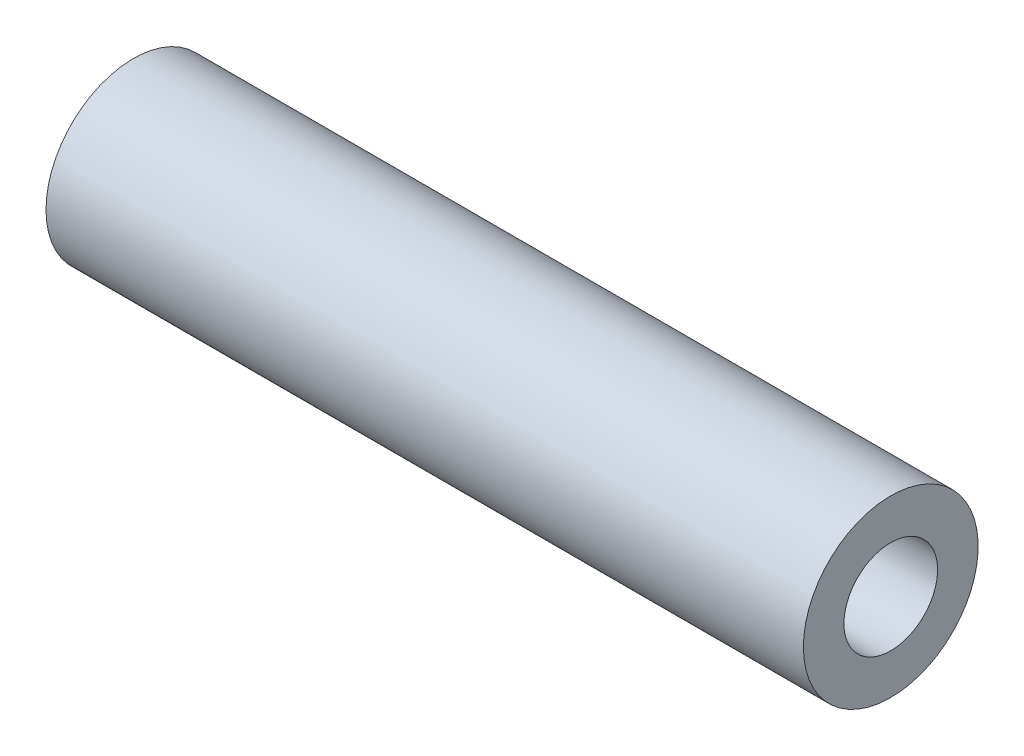
ISO-10303-21;
HEADER;
FILE_DESCRIPTION(('STEP AP214'),'2;1');
FILE_NAME('part.step','',(''),(''),'','','');
FILE_SCHEMA(('AUTOMOTIVE_DESIGN { 1 0 10303 214 1 1 1 1 }'));
ENDSEC;
DATA;
#1=APPLICATION_CONTEXT('core data for automotive mechanical design processes');
#2=APPLICATION_PROTOCOL_DEFINITION('international standard','automotive_design',2000,#1);
#3=PRODUCT_CONTEXT('',#1,'mechanical');
#4=PRODUCT('Part','Part','',(#3));
#5=PRODUCT_RELATED_PRODUCT_CATEGORY('part','',(#4));
#6=PRODUCT_DEFINITION_FORMATION('','',#4);
#7=PRODUCT_DEFINITION_CONTEXT('part definition',#1,'design');
#8=PRODUCT_DEFINITION('design','',#6,#7);
#9=PRODUCT_DEFINITION_SHAPE('','',#8);
#10=(LENGTH_UNIT() NAMED_UNIT(*) SI_UNIT(.MILLI.,.METRE.));
#11=(NAMED_UNIT(*) PLANE_ANGLE_UNIT() SI_UNIT($,.RADIAN.));
#12=(NAMED_UNIT(*) SI_UNIT($,.STERADIAN.) SOLID_ANGLE_UNIT());
#13=UNCERTAINTY_MEASURE_WITH_UNIT(LENGTH_MEASURE(1.E-05),#10,'distance_accuracy_value','');
#14=(GEOMETRIC_REPRESENTATION_CONTEXT(3) GLOBAL_UNCERTAINTY_ASSIGNED_CONTEXT((#13)) GLOBAL_UNIT_ASSIGNED_CONTEXT((#10,
#11,#12)) REPRESENTATION_CONTEXT('',''));
#15=CARTESIAN_POINT('',(0.,0.,0.));
#16=DIRECTION('',(0.,0.,1.));
#17=DIRECTION('',(1.,0.,0.));
#18=AXIS2_PLACEMENT_3D('',#15,#16,#17);
#19=CARTESIAN_POINT('',(20.6375,0.,0.));
#20=DIRECTION('',(-1.,0.,0.));
#21=DIRECTION('',(0.,0.,1.));
#22=AXIS2_PLACEMENT_3D('',#19,#20,#21);
#23=CYLINDRICAL_SURFACE('',#22,2.5527);
#24=CARTESIAN_POINT('',(-20.6375,0.,0.));
#25=DIRECTION('',(-1.,0.,0.));
#26=DIRECTION('',(0.,0.,1.));
#27=AXIS2_PLACEMENT_3D('',#24,#25,#26);
#28=CIRCLE('',#27,2.5527);
#29=CARTESIAN_POINT('',(-20.6375,0.,2.5527));
#30=VERTEX_POINT('',#29);
#31=EDGE_CURVE('E26',#30,#30,#28,.T.);
#32=ORIENTED_EDGE('',*,*,#31,.T.);
#33=EDGE_LOOP('',(#32));
#34=FACE_BOUND('',#33,.T.);
#35=CARTESIAN_POINT('',(20.6375,0.,0.));
#36=DIRECTION('',(-1.,0.,0.));
#37=DIRECTION('',(0.,0.,1.));
#38=AXIS2_PLACEMENT_3D('',#35,#36,#37);
#39=CIRCLE('',#38,2.5527);
#40=CARTESIAN_POINT('',(20.6375,0.,2.5527));
#41=VERTEX_POINT('',#40);
#42=EDGE_CURVE('E17',#41,#41,#39,.T.);
#43=ORIENTED_EDGE('',*,*,#42,.F.);
#44=EDGE_LOOP('',(#43));
#45=FACE_BOUND('',#44,.T.);
#46=ADVANCED_FACE('F14',(#34,#45),#23,.F.);
#47=CARTESIAN_POINT('',(20.6375,0.,0.));
#48=DIRECTION('',(1.,0.,0.));
#49=DIRECTION('',(0.,0.,-1.));
#50=AXIS2_PLACEMENT_3D('',#47,#48,#49);
#51=PLANE('',#50);
#52=ORIENTED_EDGE('',*,*,#42,.T.);
#53=EDGE_LOOP('',(#52));
#54=FACE_BOUND('',#53,.T.);
#55=CARTESIAN_POINT('',(20.6375,0.,0.));
#56=DIRECTION('',(-1.,0.,0.));
#57=DIRECTION('',(0.,0.,1.));
#58=AXIS2_PLACEMENT_3D('',#55,#56,#57);
#59=CIRCLE('',#58,4.7625);
#60=CARTESIAN_POINT('',(20.6375,0.,4.7625));
#61=VERTEX_POINT('',#60);
#62=EDGE_CURVE('E21',#61,#61,#59,.T.);
#63=ORIENTED_EDGE('',*,*,#62,.F.);
#64=EDGE_LOOP('',(#63));
#65=FACE_BOUND('',#64,.T.);
#66=ADVANCED_FACE('F34',(#54,#65),#51,.T.);
#67=CARTESIAN_POINT('',(-20.6375,0.,0.));
#68=DIRECTION('',(1.,0.,0.));
#69=DIRECTION('',(0.,0.,-1.));
#70=AXIS2_PLACEMENT_3D('',#67,#68,#69);
#71=PLANE('',#70);
#72=ORIENTED_EDGE('',*,*,#31,.F.);
#73=EDGE_LOOP('',(#72));
#74=FACE_BOUND('',#73,.T.);
#75=CARTESIAN_POINT('',(-20.6375,0.,0.));
#76=DIRECTION('',(-1.,0.,0.));
#77=DIRECTION('',(0.,0.,1.));
#78=AXIS2_PLACEMENT_3D('',#75,#76,#77);
#79=CIRCLE('',#78,4.7625);
#80=CARTESIAN_POINT('',(-20.6375,0.,4.7625));
#81=VERTEX_POINT('',#80);
#82=EDGE_CURVE('E10',#81,#81,#79,.F.);
#83=ORIENTED_EDGE('',*,*,#82,.F.);
#84=EDGE_LOOP('',(#83));
#85=FACE_BOUND('',#84,.T.);
#86=ADVANCED_FACE('F42',(#74,#85),#71,.F.);
#87=CARTESIAN_POINT('',(20.6375,0.,0.));
#88=DIRECTION('',(-1.,0.,0.));
#89=DIRECTION('',(0.,0.,1.));
#90=AXIS2_PLACEMENT_3D('',#87,#88,#89);
#91=CYLINDRICAL_SURFACE('',#90,4.7625);
#92=ORIENTED_EDGE('',*,*,#82,.T.);
#93=EDGE_LOOP('',(#92));
#94=FACE_BOUND('',#93,.T.);
#95=ORIENTED_EDGE('',*,*,#62,.T.);
#96=EDGE_LOOP('',(#95));
#97=FACE_BOUND('',#96,.T.);
#98=ADVANCED_FACE('F43',(#94,#97),#91,.T.);
#99=CLOSED_SHELL('',(#46,#66,#86,#98));
#100=MANIFOLD_SOLID_BREP('B1',#99);
#101=ADVANCED_BREP_SHAPE_REPRESENTATION('',(#18,#100),#14);
#102=SHAPE_DEFINITION_REPRESENTATION(#9,#101);
ENDSEC;
END-ISO-10303-21;
